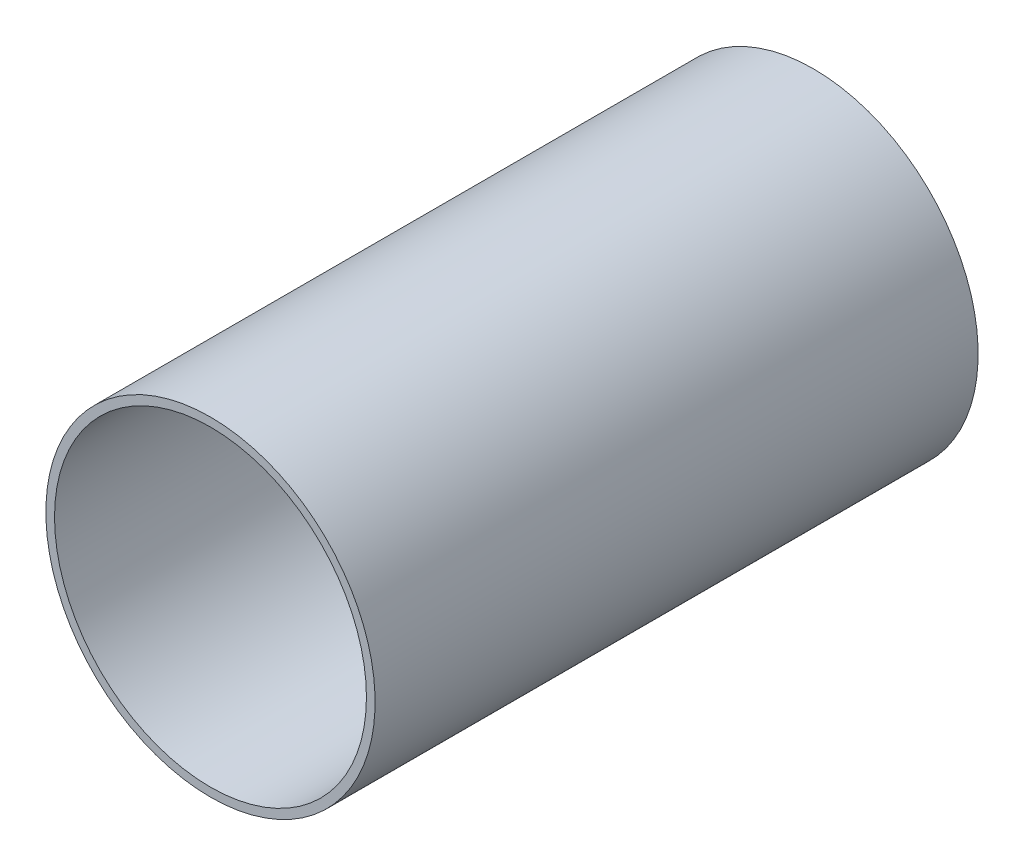
ISO-10303-21;
HEADER;
FILE_DESCRIPTION(('STEP AP214'),'2;1');
FILE_NAME('part.step','',(''),(''),'','','');
FILE_SCHEMA(('AUTOMOTIVE_DESIGN { 1 0 10303 214 1 1 1 1 }'));
ENDSEC;
DATA;
#1=APPLICATION_CONTEXT('core data for automotive mechanical design processes');
#2=APPLICATION_PROTOCOL_DEFINITION('international standard','automotive_design',2000,#1);
#3=PRODUCT_CONTEXT('',#1,'mechanical');
#4=PRODUCT('Part','Part','',(#3));
#5=PRODUCT_RELATED_PRODUCT_CATEGORY('part','',(#4));
#6=PRODUCT_DEFINITION_FORMATION('','',#4);
#7=PRODUCT_DEFINITION_CONTEXT('part definition',#1,'design');
#8=PRODUCT_DEFINITION('design','',#6,#7);
#9=PRODUCT_DEFINITION_SHAPE('','',#8);
#10=(LENGTH_UNIT() NAMED_UNIT(*) SI_UNIT(.MILLI.,.METRE.));
#11=(NAMED_UNIT(*) PLANE_ANGLE_UNIT() SI_UNIT($,.RADIAN.));
#12=(NAMED_UNIT(*) SI_UNIT($,.STERADIAN.) SOLID_ANGLE_UNIT());
#13=UNCERTAINTY_MEASURE_WITH_UNIT(LENGTH_MEASURE(1.E-05),#10,'distance_accuracy_value','');
#14=(GEOMETRIC_REPRESENTATION_CONTEXT(3) GLOBAL_UNCERTAINTY_ASSIGNED_CONTEXT((#13)) GLOBAL_UNIT_ASSIGNED_CONTEXT((#10,
#11,#12)) REPRESENTATION_CONTEXT('',''));
#15=CARTESIAN_POINT('',(0.,0.,0.));
#16=DIRECTION('',(0.,0.,1.));
#17=DIRECTION('',(1.,0.,0.));
#18=AXIS2_PLACEMENT_3D('',#15,#16,#17);
#19=CARTESIAN_POINT('',(177.26,-124.456,-0.045));
#20=DIRECTION('',(0.,0.,-1.));
#21=DIRECTION('',(0.,-1.,0.));
#22=AXIS2_PLACEMENT_3D('',#19,#20,#21);
#23=CYLINDRICAL_SURFACE('',#22,0.45);
#24=CARTESIAN_POINT('',(177.26,-124.456,-0.035));
#25=DIRECTION('',(0.,0.,-1.));
#26=DIRECTION('',(0.,-1.,0.));
#27=AXIS2_PLACEMENT_3D('',#24,#25,#26);
#28=CIRCLE('',#27,0.45);
#29=CARTESIAN_POINT('',(177.26,-124.906,-0.035));
#30=VERTEX_POINT('',#29);
#31=EDGE_CURVE('E64',#30,#30,#28,.T.);
#32=ORIENTED_EDGE('',*,*,#31,.T.);
#33=DIRECTION('',(0.,0.,1.));
#34=VECTOR('',#33,1.);
#35=CARTESIAN_POINT('',(177.26,-124.906,-0.045));
#36=LINE('',#35,#34);
#37=CARTESIAN_POINT('',(177.26,-124.906,1.705));
#38=VERTEX_POINT('',#37);
#39=EDGE_CURVE('E11',#30,#38,#36,.T.);
#40=ORIENTED_EDGE('',*,*,#39,.T.);
#41=CARTESIAN_POINT('',(177.26,-124.456,1.705));
#42=DIRECTION('',(0.,0.,-1.));
#43=DIRECTION('',(0.,-1.,0.));
#44=AXIS2_PLACEMENT_3D('',#41,#42,#43);
#45=CIRCLE('',#44,0.45);
#46=EDGE_CURVE('E25',#38,#38,#45,.T.);
#47=ORIENTED_EDGE('',*,*,#46,.F.);
#48=ORIENTED_EDGE('',*,*,#39,.F.);
#49=EDGE_LOOP('',(#32,#40,#47,#48));
#50=FACE_BOUND('',#49,.T.);
#51=ADVANCED_FACE('F17',(#50),#23,.F.);
#52=CARTESIAN_POINT('',(177.26,-124.931,1.705));
#53=DIRECTION('',(0.,0.,1.));
#54=DIRECTION('',(1.,0.,0.));
#55=AXIS2_PLACEMENT_3D('',#52,#53,#54);
#56=PLANE('',#55);
#57=ORIENTED_EDGE('',*,*,#46,.T.);
#58=EDGE_LOOP('',(#57));
#59=FACE_BOUND('',#58,.T.);
#60=CARTESIAN_POINT('',(177.26,-124.456,1.705));
#61=DIRECTION('',(0.,0.,1.));
#62=DIRECTION('',(0.,-1.,0.));
#63=AXIS2_PLACEMENT_3D('',#60,#61,#62);
#64=CIRCLE('',#63,0.475);
#65=CARTESIAN_POINT('',(177.26,-124.931,1.705));
#66=VERTEX_POINT('',#65);
#67=EDGE_CURVE('E56',#66,#66,#64,.T.);
#68=ORIENTED_EDGE('',*,*,#67,.T.);
#69=EDGE_LOOP('',(#68));
#70=FACE_BOUND('',#69,.T.);
#71=ADVANCED_FACE('F80',(#59,#70),#56,.T.);
#72=CARTESIAN_POINT('',(177.26,-124.931,-0.035));
#73=DIRECTION('',(0.,0.,1.));
#74=DIRECTION('',(1.,0.,0.));
#75=AXIS2_PLACEMENT_3D('',#72,#73,#74);
#76=PLANE('',#75);
#77=ORIENTED_EDGE('',*,*,#31,.F.);
#78=EDGE_LOOP('',(#77));
#79=FACE_BOUND('',#78,.T.);
#80=CARTESIAN_POINT('',(177.26,-124.456,-0.035));
#81=DIRECTION('',(0.,0.,1.));
#82=DIRECTION('',(0.,-1.,0.));
#83=AXIS2_PLACEMENT_3D('',#80,#81,#82);
#84=CIRCLE('',#83,0.475);
#85=CARTESIAN_POINT('',(177.26,-124.931,-0.035));
#86=VERTEX_POINT('',#85);
#87=EDGE_CURVE('E55',#86,#86,#84,.T.);
#88=ORIENTED_EDGE('',*,*,#87,.F.);
#89=EDGE_LOOP('',(#88));
#90=FACE_BOUND('',#89,.T.);
#91=ADVANCED_FACE('F77',(#79,#90),#76,.F.);
#92=CARTESIAN_POINT('',(177.26,-124.456,-0.035));
#93=DIRECTION('',(0.,0.,-1.));
#94=DIRECTION('',(0.,-1.,0.));
#95=AXIS2_PLACEMENT_3D('',#92,#93,#94);
#96=CYLINDRICAL_SURFACE('',#95,0.475);
#97=ORIENTED_EDGE('',*,*,#87,.T.);
#98=DIRECTION('',(0.,0.,1.));
#99=VECTOR('',#98,1.);
#100=CARTESIAN_POINT('',(177.26,-124.931,-0.035));
#101=LINE('',#100,#99);
#102=EDGE_CURVE('E52',#86,#66,#101,.T.);
#103=ORIENTED_EDGE('',*,*,#102,.T.);
#104=ORIENTED_EDGE('',*,*,#67,.F.);
#105=ORIENTED_EDGE('',*,*,#102,.F.);
#106=EDGE_LOOP('',(#97,#103,#104,#105));
#107=FACE_BOUND('',#106,.T.);
#108=ADVANCED_FACE('F53',(#107),#96,.T.);
#109=CLOSED_SHELL('',(#51,#71,#91,#108));
#110=MANIFOLD_SOLID_BREP('B1',#109);
#111=ADVANCED_BREP_SHAPE_REPRESENTATION('',(#18,#110),#14);
#112=SHAPE_DEFINITION_REPRESENTATION(#9,#111);
ENDSEC;
END-ISO-10303-21;
